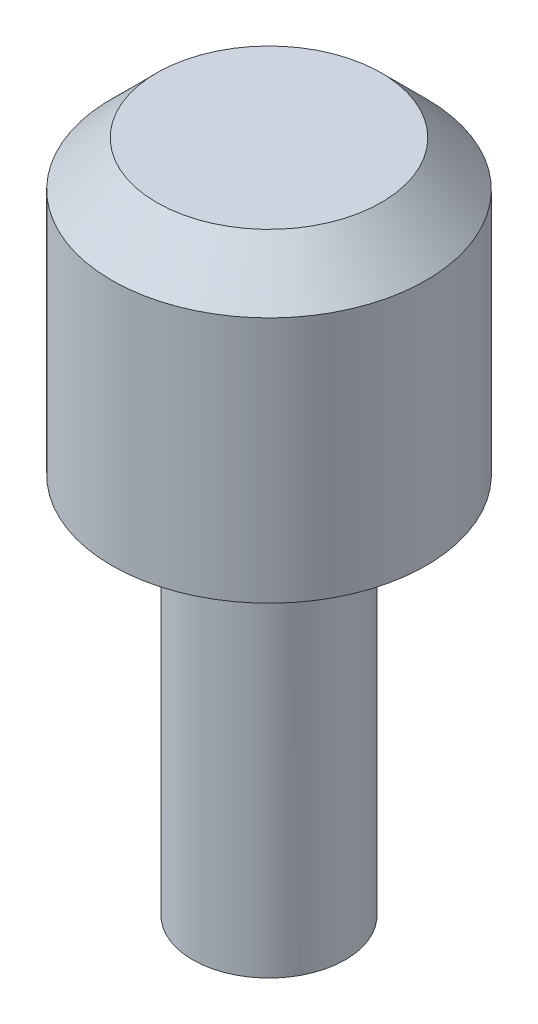
ISO-10303-21;
HEADER;
FILE_DESCRIPTION(('STEP AP214'),'2;1');
FILE_NAME('part.step','',(''),(''),'','','');
FILE_SCHEMA(('AUTOMOTIVE_DESIGN { 1 0 10303 214 1 1 1 1 }'));
ENDSEC;
DATA;
#1=APPLICATION_CONTEXT('core data for automotive mechanical design processes');
#2=APPLICATION_PROTOCOL_DEFINITION('international standard','automotive_design',2000,#1);
#3=PRODUCT_CONTEXT('',#1,'mechanical');
#4=PRODUCT('Part','Part','',(#3));
#5=PRODUCT_RELATED_PRODUCT_CATEGORY('part','',(#4));
#6=PRODUCT_DEFINITION_FORMATION('','',#4);
#7=PRODUCT_DEFINITION_CONTEXT('part definition',#1,'design');
#8=PRODUCT_DEFINITION('design','',#6,#7);
#9=PRODUCT_DEFINITION_SHAPE('','',#8);
#10=(LENGTH_UNIT() NAMED_UNIT(*) SI_UNIT(.MILLI.,.METRE.));
#11=(NAMED_UNIT(*) PLANE_ANGLE_UNIT() SI_UNIT($,.RADIAN.));
#12=(NAMED_UNIT(*) SI_UNIT($,.STERADIAN.) SOLID_ANGLE_UNIT());
#13=UNCERTAINTY_MEASURE_WITH_UNIT(LENGTH_MEASURE(1.E-05),#10,'distance_accuracy_value','');
#14=(GEOMETRIC_REPRESENTATION_CONTEXT(3) GLOBAL_UNCERTAINTY_ASSIGNED_CONTEXT((#13)) GLOBAL_UNIT_ASSIGNED_CONTEXT((#10,
#11,#12)) REPRESENTATION_CONTEXT('',''));
#15=CARTESIAN_POINT('',(0.,0.,0.));
#16=DIRECTION('',(0.,0.,1.));
#17=DIRECTION('',(1.,0.,0.));
#18=AXIS2_PLACEMENT_3D('',#15,#16,#17);
#19=CARTESIAN_POINT('',(0.,0.,0.));
#20=DIRECTION('',(0.,1.,0.));
#21=DIRECTION('',(0.,0.,1.));
#22=AXIS2_PLACEMENT_3D('',#19,#20,#21);
#23=PLANE('',#22);
#24=CARTESIAN_POINT('',(0.,0.,0.));
#25=DIRECTION('',(0.,1.,0.));
#26=DIRECTION('',(0.,0.,1.));
#27=AXIS2_PLACEMENT_3D('',#24,#25,#26);
#28=CIRCLE('',#27,3.5);
#29=CARTESIAN_POINT('',(0.,0.,3.5));
#30=VERTEX_POINT('',#29);
#31=EDGE_CURVE('E48',#30,#30,#28,.T.);
#32=ORIENTED_EDGE('',*,*,#31,.F.);
#33=EDGE_LOOP('',(#32));
#34=FACE_BOUND('',#33,.T.);
#35=CARTESIAN_POINT('',(0.,0.,0.));
#36=DIRECTION('',(0.,1.,0.));
#37=DIRECTION('',(0.,0.,1.));
#38=AXIS2_PLACEMENT_3D('',#35,#36,#37);
#39=CIRCLE('',#38,1.7);
#40=CARTESIAN_POINT('',(0.,0.,1.7));
#41=VERTEX_POINT('',#40);
#42=EDGE_CURVE('E10',#41,#41,#39,.F.);
#43=ORIENTED_EDGE('',*,*,#42,.F.);
#44=EDGE_LOOP('',(#43));
#45=FACE_BOUND('',#44,.T.);
#46=ADVANCED_FACE('F33',(#34,#45),#23,.F.);
#47=CARTESIAN_POINT('',(0.,6.5,0.));
#48=DIRECTION('',(0.,-1.,0.));
#49=DIRECTION('',(0.,0.,-1.));
#50=AXIS2_PLACEMENT_3D('',#47,#48,#49);
#51=CYLINDRICAL_SURFACE('',#50,3.5);
#52=CARTESIAN_POINT('',(0.,5.5,0.));
#53=DIRECTION('',(0.,1.,0.));
#54=DIRECTION('',(0.,0.,1.));
#55=AXIS2_PLACEMENT_3D('',#52,#53,#54);
#56=CIRCLE('',#55,3.5);
#57=CARTESIAN_POINT('',(0.,5.5,3.5));
#58=VERTEX_POINT('',#57);
#59=EDGE_CURVE('E40',#58,#58,#56,.F.);
#60=ORIENTED_EDGE('',*,*,#59,.T.);
#61=EDGE_LOOP('',(#60));
#62=FACE_BOUND('',#61,.T.);
#63=ORIENTED_EDGE('',*,*,#31,.T.);
#64=EDGE_LOOP('',(#63));
#65=FACE_BOUND('',#64,.T.);
#66=ADVANCED_FACE('F71',(#62,#65),#51,.T.);
#67=CARTESIAN_POINT('',(0.,6.5,0.));
#68=DIRECTION('',(0.,1.,0.));
#69=DIRECTION('',(0.,0.,1.));
#70=AXIS2_PLACEMENT_3D('',#67,#68,#69);
#71=PLANE('',#70);
#72=CARTESIAN_POINT('',(0.,6.5,0.));
#73=DIRECTION('',(0.,1.,0.));
#74=DIRECTION('',(0.,0.,1.));
#75=AXIS2_PLACEMENT_3D('',#72,#73,#74);
#76=CIRCLE('',#75,2.50000000000001);
#77=CARTESIAN_POINT('',(0.,6.5,2.50000000000001));
#78=VERTEX_POINT('',#77);
#79=EDGE_CURVE('E44',#78,#78,#76,.T.);
#80=ORIENTED_EDGE('',*,*,#79,.T.);
#81=EDGE_LOOP('',(#80));
#82=FACE_BOUND('',#81,.T.);
#83=ADVANCED_FACE('F67',(#82),#71,.T.);
#84=CARTESIAN_POINT('',(0.,6.5,0.));
#85=DIRECTION('',(0.,-1.,0.));
#86=DIRECTION('',(0.,0.,-1.));
#87=AXIS2_PLACEMENT_3D('',#84,#85,#86);
#88=CONICAL_SURFACE('',#87,2.50000000000001,0.785398163397446);
#89=ORIENTED_EDGE('',*,*,#59,.F.);
#90=EDGE_LOOP('',(#89));
#91=FACE_BOUND('',#90,.T.);
#92=ORIENTED_EDGE('',*,*,#79,.F.);
#93=EDGE_LOOP('',(#92));
#94=FACE_BOUND('',#93,.T.);
#95=ADVANCED_FACE('F35',(#91,#94),#88,.T.);
#96=CARTESIAN_POINT('',(0.,-8.5,0.));
#97=DIRECTION('',(0.,1.,0.));
#98=DIRECTION('',(0.,0.,1.));
#99=AXIS2_PLACEMENT_3D('',#96,#97,#98);
#100=CYLINDRICAL_SURFACE('',#99,1.7);
#101=CARTESIAN_POINT('',(0.,-8.5,0.));
#102=DIRECTION('',(0.,-1.,0.));
#103=DIRECTION('',(0.,0.,-1.));
#104=AXIS2_PLACEMENT_3D('',#101,#102,#103);
#105=CIRCLE('',#104,1.7);
#106=CARTESIAN_POINT('',(0.,-8.5,-1.7));
#107=VERTEX_POINT('',#106);
#108=EDGE_CURVE('E53',#107,#107,#105,.T.);
#109=ORIENTED_EDGE('',*,*,#108,.F.);
#110=EDGE_LOOP('',(#109));
#111=FACE_BOUND('',#110,.T.);
#112=ORIENTED_EDGE('',*,*,#42,.T.);
#113=EDGE_LOOP('',(#112));
#114=FACE_BOUND('',#113,.T.);
#115=ADVANCED_FACE('F59',(#111,#114),#100,.T.);
#116=CARTESIAN_POINT('',(0.,-8.5,0.));
#117=DIRECTION('',(0.,-1.,0.));
#118=DIRECTION('',(0.,0.,-1.));
#119=AXIS2_PLACEMENT_3D('',#116,#117,#118);
#120=PLANE('',#119);
#121=ORIENTED_EDGE('',*,*,#108,.T.);
#122=EDGE_LOOP('',(#121));
#123=FACE_BOUND('',#122,.T.);
#124=ADVANCED_FACE('F57',(#123),#120,.T.);
#125=CLOSED_SHELL('',(#46,#66,#83,#95,#115,#124));
#126=MANIFOLD_SOLID_BREP('B2',#125);
#127=ADVANCED_BREP_SHAPE_REPRESENTATION('',(#18,#126),#14);
#128=SHAPE_DEFINITION_REPRESENTATION(#9,#127);
ENDSEC;
END-ISO-10303-21;
